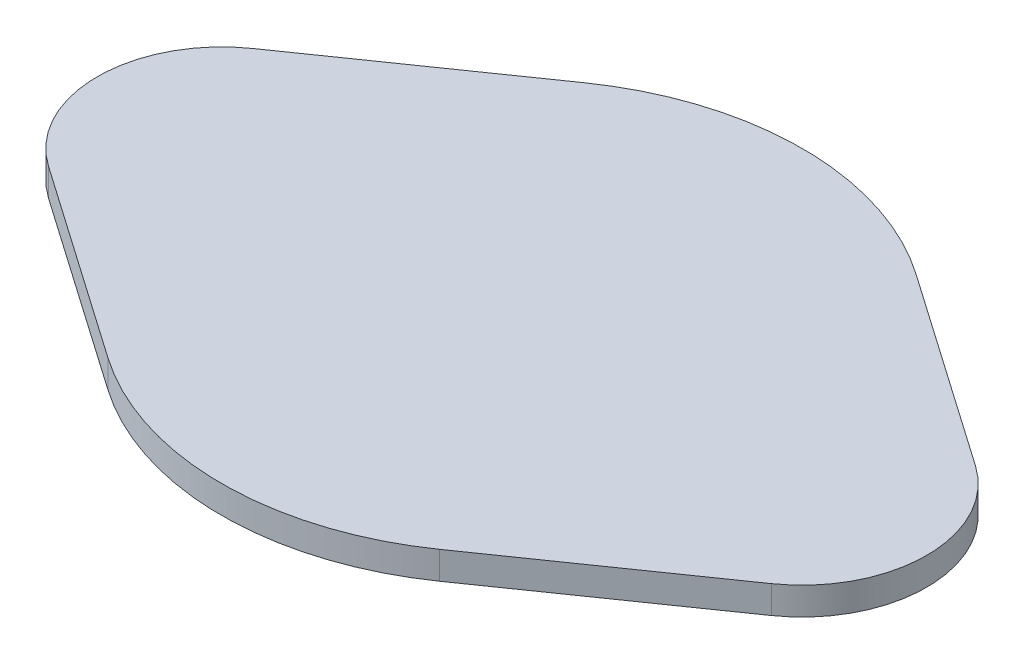
ISO-10303-21;
HEADER;
FILE_DESCRIPTION(('STEP AP214'),'2;1');
FILE_NAME('part.step','',(''),(''),'','','');
FILE_SCHEMA(('AUTOMOTIVE_DESIGN { 1 0 10303 214 1 1 1 1 }'));
ENDSEC;
DATA;
#1=APPLICATION_CONTEXT('core data for automotive mechanical design processes');
#2=APPLICATION_PROTOCOL_DEFINITION('international standard','automotive_design',2000,#1);
#3=PRODUCT_CONTEXT('',#1,'mechanical');
#4=PRODUCT('Part','Part','',(#3));
#5=PRODUCT_RELATED_PRODUCT_CATEGORY('part','',(#4));
#6=PRODUCT_DEFINITION_FORMATION('','',#4);
#7=PRODUCT_DEFINITION_CONTEXT('part definition',#1,'design');
#8=PRODUCT_DEFINITION('design','',#6,#7);
#9=PRODUCT_DEFINITION_SHAPE('','',#8);
#10=(LENGTH_UNIT() NAMED_UNIT(*) SI_UNIT(.MILLI.,.METRE.));
#11=(NAMED_UNIT(*) PLANE_ANGLE_UNIT() SI_UNIT($,.RADIAN.));
#12=(NAMED_UNIT(*) SI_UNIT($,.STERADIAN.) SOLID_ANGLE_UNIT());
#13=UNCERTAINTY_MEASURE_WITH_UNIT(LENGTH_MEASURE(1.E-05),#10,'distance_accuracy_value','');
#14=(GEOMETRIC_REPRESENTATION_CONTEXT(3) GLOBAL_UNCERTAINTY_ASSIGNED_CONTEXT((#13)) GLOBAL_UNIT_ASSIGNED_CONTEXT((#10,
#11,#12)) REPRESENTATION_CONTEXT('',''));
#15=CARTESIAN_POINT('',(0.,0.,0.));
#16=DIRECTION('',(0.,0.,1.));
#17=DIRECTION('',(1.,0.,0.));
#18=AXIS2_PLACEMENT_3D('',#15,#16,#17);
#19=CARTESIAN_POINT('',(0.,5.,0.));
#20=DIRECTION('',(0.,-1.,0.));
#21=DIRECTION('',(0.,0.,-1.));
#22=AXIS2_PLACEMENT_3D('',#19,#20,#21);
#23=CYLINDRICAL_SURFACE('',#22,52.5);
#24=CARTESIAN_POINT('',(0.,0.,0.));
#25=DIRECTION('',(0.,1.,0.));
#26=DIRECTION('',(0.,0.,1.));
#27=AXIS2_PLACEMENT_3D('',#24,#25,#26);
#28=CIRCLE('',#27,52.5);
#29=CARTESIAN_POINT('',(30.,0.,-43.0842198490352));
#30=VERTEX_POINT('',#29);
#31=CARTESIAN_POINT('',(-30.,0.,-43.0842198490352));
#32=VERTEX_POINT('',#31);
#33=EDGE_CURVE('E129',#30,#32,#28,.T.);
#34=ORIENTED_EDGE('',*,*,#33,.T.);
#35=DIRECTION('',(0.,-1.,0.));
#36=VECTOR('',#35,1.);
#37=CARTESIAN_POINT('',(-30.,5.,-43.0842198490352));
#38=LINE('',#37,#36);
#39=CARTESIAN_POINT('',(-30.,5.,-43.0842198490352));
#40=VERTEX_POINT('',#39);
#41=EDGE_CURVE('E11',#40,#32,#38,.T.);
#42=ORIENTED_EDGE('',*,*,#41,.F.);
#43=CARTESIAN_POINT('',(0.,5.,0.));
#44=DIRECTION('',(0.,1.,0.));
#45=DIRECTION('',(0.,0.,1.));
#46=AXIS2_PLACEMENT_3D('',#43,#44,#45);
#47=CIRCLE('',#46,52.5);
#48=CARTESIAN_POINT('',(30.,5.,-43.0842198490352));
#49=VERTEX_POINT('',#48);
#50=EDGE_CURVE('E143',#49,#40,#47,.T.);
#51=ORIENTED_EDGE('',*,*,#50,.F.);
#52=DIRECTION('',(0.,-1.,0.));
#53=VECTOR('',#52,1.);
#54=CARTESIAN_POINT('',(30.,5.,-43.0842198490352));
#55=LINE('',#54,#53);
#56=EDGE_CURVE('E125',#49,#30,#55,.T.);
#57=ORIENTED_EDGE('',*,*,#56,.T.);
#58=EDGE_LOOP('',(#34,#42,#51,#57));
#59=FACE_BOUND('',#58,.T.);
#60=ADVANCED_FACE('F33',(#59),#23,.T.);
#61=CARTESIAN_POINT('',(-30.,5.,-43.0842198490352));
#62=DIRECTION('',(0.571428571428572,0.,0.82065180664829));
#63=DIRECTION('',(0.82065180664829,0.,-0.571428571428572));
#64=AXIS2_PLACEMENT_3D('',#61,#62,#63);
#65=PLANE('',#64);
#66=DIRECTION('',(-0.82065180664829,0.,0.571428571428572));
#67=VECTOR('',#66,1.);
#68=CARTESIAN_POINT('',(-30.,0.,-43.0842198490352));
#69=LINE('',#68,#67);
#70=CARTESIAN_POINT('',(-65.3571428571429,0.,-18.4646656495865));
#71=VERTEX_POINT('',#70);
#72=EDGE_CURVE('E132',#32,#71,#69,.T.);
#73=ORIENTED_EDGE('',*,*,#72,.T.);
#74=DIRECTION('',(0.,-1.,0.));
#75=VECTOR('',#74,1.);
#76=CARTESIAN_POINT('',(-65.3571428571429,5.,-18.4646656495865));
#77=LINE('',#76,#75);
#78=CARTESIAN_POINT('',(-65.3571428571429,5.,-18.4646656495865));
#79=VERTEX_POINT('',#78);
#80=EDGE_CURVE('E41',#79,#71,#77,.T.);
#81=ORIENTED_EDGE('',*,*,#80,.F.);
#82=DIRECTION('',(-0.82065180664829,0.,0.571428571428572));
#83=VECTOR('',#82,1.);
#84=CARTESIAN_POINT('',(-30.,5.,-43.0842198490352));
#85=LINE('',#84,#83);
#86=EDGE_CURVE('E92',#40,#79,#85,.T.);
#87=ORIENTED_EDGE('',*,*,#86,.F.);
#88=ORIENTED_EDGE('',*,*,#41,.T.);
#89=EDGE_LOOP('',(#73,#81,#87,#88));
#90=FACE_BOUND('',#89,.T.);
#91=ADVANCED_FACE('F178',(#90),#65,.F.);
#92=CARTESIAN_POINT('',(-52.5,5.,0.));
#93=DIRECTION('',(0.,-1.,0.));
#94=DIRECTION('',(0.,0.,-1.));
#95=AXIS2_PLACEMENT_3D('',#92,#93,#94);
#96=CYLINDRICAL_SURFACE('',#95,22.5);
#97=CARTESIAN_POINT('',(-52.5,0.,0.));
#98=DIRECTION('',(0.,1.,0.));
#99=DIRECTION('',(0.,0.,1.));
#100=AXIS2_PLACEMENT_3D('',#97,#98,#99);
#101=CIRCLE('',#100,22.5);
#102=CARTESIAN_POINT('',(-65.3571428571429,0.,18.4646656495865));
#103=VERTEX_POINT('',#102);
#104=EDGE_CURVE('E134',#71,#103,#101,.T.);
#105=ORIENTED_EDGE('',*,*,#104,.T.);
#106=DIRECTION('',(0.,-1.,0.));
#107=VECTOR('',#106,1.);
#108=CARTESIAN_POINT('',(-65.3571428571429,5.,18.4646656495865));
#109=LINE('',#108,#107);
#110=CARTESIAN_POINT('',(-65.3571428571429,5.,18.4646656495865));
#111=VERTEX_POINT('',#110);
#112=EDGE_CURVE('E150',#111,#103,#109,.T.);
#113=ORIENTED_EDGE('',*,*,#112,.F.);
#114=CARTESIAN_POINT('',(-52.5,5.,0.));
#115=DIRECTION('',(0.,1.,0.));
#116=DIRECTION('',(0.,0.,1.));
#117=AXIS2_PLACEMENT_3D('',#114,#115,#116);
#118=CIRCLE('',#117,22.5);
#119=EDGE_CURVE('E158',#79,#111,#118,.T.);
#120=ORIENTED_EDGE('',*,*,#119,.F.);
#121=ORIENTED_EDGE('',*,*,#80,.T.);
#122=EDGE_LOOP('',(#105,#113,#120,#121));
#123=FACE_BOUND('',#122,.T.);
#124=ADVANCED_FACE('F156',(#123),#96,.T.);
#125=CARTESIAN_POINT('',(-65.3571428571428,5.,18.4646656495865));
#126=DIRECTION('',(0.571428571428571,0.,-0.82065180664829));
#127=DIRECTION('',(-0.82065180664829,0.,-0.571428571428571));
#128=AXIS2_PLACEMENT_3D('',#125,#126,#127);
#129=PLANE('',#128);
#130=DIRECTION('',(0.82065180664829,0.,0.571428571428571));
#131=VECTOR('',#130,1.);
#132=CARTESIAN_POINT('',(-65.3571428571428,0.,18.4646656495865));
#133=LINE('',#132,#131);
#134=CARTESIAN_POINT('',(-30.,0.,43.0842198490352));
#135=VERTEX_POINT('',#134);
#136=EDGE_CURVE('E136',#103,#135,#133,.T.);
#137=ORIENTED_EDGE('',*,*,#136,.T.);
#138=DIRECTION('',(0.,-1.,0.));
#139=VECTOR('',#138,1.);
#140=CARTESIAN_POINT('',(-30.,5.,43.0842198490352));
#141=LINE('',#140,#139);
#142=CARTESIAN_POINT('',(-30.,5.,43.0842198490352));
#143=VERTEX_POINT('',#142);
#144=EDGE_CURVE('E147',#143,#135,#141,.T.);
#145=ORIENTED_EDGE('',*,*,#144,.F.);
#146=DIRECTION('',(0.82065180664829,0.,0.571428571428571));
#147=VECTOR('',#146,1.);
#148=CARTESIAN_POINT('',(-65.3571428571428,5.,18.4646656495865));
#149=LINE('',#148,#147);
#150=EDGE_CURVE('E170',#111,#143,#149,.T.);
#151=ORIENTED_EDGE('',*,*,#150,.F.);
#152=ORIENTED_EDGE('',*,*,#112,.T.);
#153=EDGE_LOOP('',(#137,#145,#151,#152));
#154=FACE_BOUND('',#153,.T.);
#155=ADVANCED_FACE('F166',(#154),#129,.F.);
#156=CARTESIAN_POINT('',(0.,5.,0.));
#157=DIRECTION('',(0.,-1.,0.));
#158=DIRECTION('',(0.,0.,-1.));
#159=AXIS2_PLACEMENT_3D('',#156,#157,#158);
#160=CYLINDRICAL_SURFACE('',#159,52.5);
#161=CARTESIAN_POINT('',(0.,0.,0.));
#162=DIRECTION('',(0.,1.,0.));
#163=DIRECTION('',(0.,0.,1.));
#164=AXIS2_PLACEMENT_3D('',#161,#162,#163);
#165=CIRCLE('',#164,52.5);
#166=CARTESIAN_POINT('',(30.,0.,43.0842198490352));
#167=VERTEX_POINT('',#166);
#168=EDGE_CURVE('E138',#135,#167,#165,.T.);
#169=ORIENTED_EDGE('',*,*,#168,.T.);
#170=DIRECTION('',(0.,-1.,0.));
#171=VECTOR('',#170,1.);
#172=CARTESIAN_POINT('',(30.,5.,43.0842198490352));
#173=LINE('',#172,#171);
#174=CARTESIAN_POINT('',(30.,5.,43.0842198490352));
#175=VERTEX_POINT('',#174);
#176=EDGE_CURVE('E120',#175,#167,#173,.T.);
#177=ORIENTED_EDGE('',*,*,#176,.F.);
#178=CARTESIAN_POINT('',(0.,5.,0.));
#179=DIRECTION('',(0.,1.,0.));
#180=DIRECTION('',(0.,0.,1.));
#181=AXIS2_PLACEMENT_3D('',#178,#179,#180);
#182=CIRCLE('',#181,52.5);
#183=EDGE_CURVE('E111',#143,#175,#182,.T.);
#184=ORIENTED_EDGE('',*,*,#183,.F.);
#185=ORIENTED_EDGE('',*,*,#144,.T.);
#186=EDGE_LOOP('',(#169,#177,#184,#185));
#187=FACE_BOUND('',#186,.T.);
#188=ADVANCED_FACE('F169',(#187),#160,.T.);
#189=CARTESIAN_POINT('',(65.3571428571428,5.,18.4646656495865));
#190=DIRECTION('',(-0.571428571428572,0.,-0.82065180664829));
#191=DIRECTION('',(-0.82065180664829,0.,0.571428571428572));
#192=AXIS2_PLACEMENT_3D('',#189,#190,#191);
#193=PLANE('',#192);
#194=DIRECTION('',(0.82065180664829,0.,-0.571428571428572));
#195=VECTOR('',#194,1.);
#196=CARTESIAN_POINT('',(65.3571428571428,0.,18.4646656495865));
#197=LINE('',#196,#195);
#198=CARTESIAN_POINT('',(65.3571428571428,0.,18.4646656495865));
#199=VERTEX_POINT('',#198);
#200=EDGE_CURVE('E119',#167,#199,#197,.T.);
#201=ORIENTED_EDGE('',*,*,#200,.T.);
#202=DIRECTION('',(0.,-1.,0.));
#203=VECTOR('',#202,1.);
#204=CARTESIAN_POINT('',(65.3571428571428,5.,18.4646656495865));
#205=LINE('',#204,#203);
#206=CARTESIAN_POINT('',(65.3571428571428,5.,18.4646656495865));
#207=VERTEX_POINT('',#206);
#208=EDGE_CURVE('E116',#207,#199,#205,.T.);
#209=ORIENTED_EDGE('',*,*,#208,.F.);
#210=DIRECTION('',(0.82065180664829,0.,-0.571428571428572));
#211=VECTOR('',#210,1.);
#212=CARTESIAN_POINT('',(65.3571428571428,5.,18.4646656495865));
#213=LINE('',#212,#211);
#214=EDGE_CURVE('E105',#175,#207,#213,.T.);
#215=ORIENTED_EDGE('',*,*,#214,.F.);
#216=ORIENTED_EDGE('',*,*,#176,.T.);
#217=EDGE_LOOP('',(#201,#209,#215,#216));
#218=FACE_BOUND('',#217,.T.);
#219=ADVANCED_FACE('F117',(#218),#193,.F.);
#220=CARTESIAN_POINT('',(52.5,5.,0.));
#221=DIRECTION('',(0.,-1.,0.));
#222=DIRECTION('',(0.,0.,-1.));
#223=AXIS2_PLACEMENT_3D('',#220,#221,#222);
#224=CYLINDRICAL_SURFACE('',#223,22.5);
#225=CARTESIAN_POINT('',(52.5,0.,0.));
#226=DIRECTION('',(0.,1.,0.));
#227=DIRECTION('',(0.,0.,1.));
#228=AXIS2_PLACEMENT_3D('',#225,#226,#227);
#229=CIRCLE('',#228,22.5);
#230=CARTESIAN_POINT('',(65.3571428571429,0.,-18.4646656495865));
#231=VERTEX_POINT('',#230);
#232=EDGE_CURVE('E78',#199,#231,#229,.T.);
#233=ORIENTED_EDGE('',*,*,#232,.T.);
#234=DIRECTION('',(0.,-1.,0.));
#235=VECTOR('',#234,1.);
#236=CARTESIAN_POINT('',(65.3571428571429,5.,-18.4646656495865));
#237=LINE('',#236,#235);
#238=CARTESIAN_POINT('',(65.3571428571429,5.,-18.4646656495865));
#239=VERTEX_POINT('',#238);
#240=EDGE_CURVE('E121',#239,#231,#237,.T.);
#241=ORIENTED_EDGE('',*,*,#240,.F.);
#242=CARTESIAN_POINT('',(52.5,5.,0.));
#243=DIRECTION('',(0.,1.,0.));
#244=DIRECTION('',(0.,0.,1.));
#245=AXIS2_PLACEMENT_3D('',#242,#243,#244);
#246=CIRCLE('',#245,22.5);
#247=EDGE_CURVE('E109',#207,#239,#246,.T.);
#248=ORIENTED_EDGE('',*,*,#247,.F.);
#249=ORIENTED_EDGE('',*,*,#208,.T.);
#250=EDGE_LOOP('',(#233,#241,#248,#249));
#251=FACE_BOUND('',#250,.T.);
#252=ADVANCED_FACE('F123',(#251),#224,.T.);
#253=CARTESIAN_POINT('',(30.,5.,-43.0842198490352));
#254=DIRECTION('',(-0.571428571428571,0.,0.82065180664829));
#255=DIRECTION('',(0.82065180664829,0.,0.571428571428571));
#256=AXIS2_PLACEMENT_3D('',#253,#254,#255);
#257=PLANE('',#256);
#258=DIRECTION('',(-0.82065180664829,0.,-0.571428571428571));
#259=VECTOR('',#258,1.);
#260=CARTESIAN_POINT('',(30.,0.,-43.0842198490352));
#261=LINE('',#260,#259);
#262=EDGE_CURVE('E84',#231,#30,#261,.T.);
#263=ORIENTED_EDGE('',*,*,#262,.T.);
#264=ORIENTED_EDGE('',*,*,#56,.F.);
#265=DIRECTION('',(-0.82065180664829,0.,-0.571428571428571));
#266=VECTOR('',#265,1.);
#267=CARTESIAN_POINT('',(30.,5.,-43.0842198490352));
#268=LINE('',#267,#266);
#269=EDGE_CURVE('E49',#239,#49,#268,.T.);
#270=ORIENTED_EDGE('',*,*,#269,.F.);
#271=ORIENTED_EDGE('',*,*,#240,.T.);
#272=EDGE_LOOP('',(#263,#264,#270,#271));
#273=FACE_BOUND('',#272,.T.);
#274=ADVANCED_FACE('F194',(#273),#257,.F.);
#275=CARTESIAN_POINT('',(0.,5.,0.));
#276=DIRECTION('',(0.,1.,0.));
#277=DIRECTION('',(0.,0.,1.));
#278=AXIS2_PLACEMENT_3D('',#275,#276,#277);
#279=PLANE('',#278);
#280=ORIENTED_EDGE('',*,*,#50,.T.);
#281=ORIENTED_EDGE('',*,*,#86,.T.);
#282=ORIENTED_EDGE('',*,*,#119,.T.);
#283=ORIENTED_EDGE('',*,*,#150,.T.);
#284=ORIENTED_EDGE('',*,*,#183,.T.);
#285=ORIENTED_EDGE('',*,*,#214,.T.);
#286=ORIENTED_EDGE('',*,*,#247,.T.);
#287=ORIENTED_EDGE('',*,*,#269,.T.);
#288=EDGE_LOOP('',(#280,#281,#282,#283,#284,#285,#286,#287));
#289=FACE_BOUND('',#288,.T.);
#290=ADVANCED_FACE('F107',(#289),#279,.T.);
#291=CARTESIAN_POINT('',(0.,0.,0.));
#292=DIRECTION('',(0.,1.,0.));
#293=DIRECTION('',(0.,0.,1.));
#294=AXIS2_PLACEMENT_3D('',#291,#292,#293);
#295=PLANE('',#294);
#296=ORIENTED_EDGE('',*,*,#33,.F.);
#297=ORIENTED_EDGE('',*,*,#262,.F.);
#298=ORIENTED_EDGE('',*,*,#232,.F.);
#299=ORIENTED_EDGE('',*,*,#200,.F.);
#300=ORIENTED_EDGE('',*,*,#168,.F.);
#301=ORIENTED_EDGE('',*,*,#136,.F.);
#302=ORIENTED_EDGE('',*,*,#104,.F.);
#303=ORIENTED_EDGE('',*,*,#72,.F.);
#304=EDGE_LOOP('',(#296,#297,#298,#299,#300,#301,#302,#303));
#305=FACE_BOUND('',#304,.T.);
#306=ADVANCED_FACE('F162',(#305),#295,.F.);
#307=CLOSED_SHELL('',(#60,#91,#124,#155,#188,#219,#252,#274,#290,#306));
#308=MANIFOLD_SOLID_BREP('B2',#307);
#309=ADVANCED_BREP_SHAPE_REPRESENTATION('',(#18,#308),#14);
#310=SHAPE_DEFINITION_REPRESENTATION(#9,#309);
ENDSEC;
END-ISO-10303-21;
